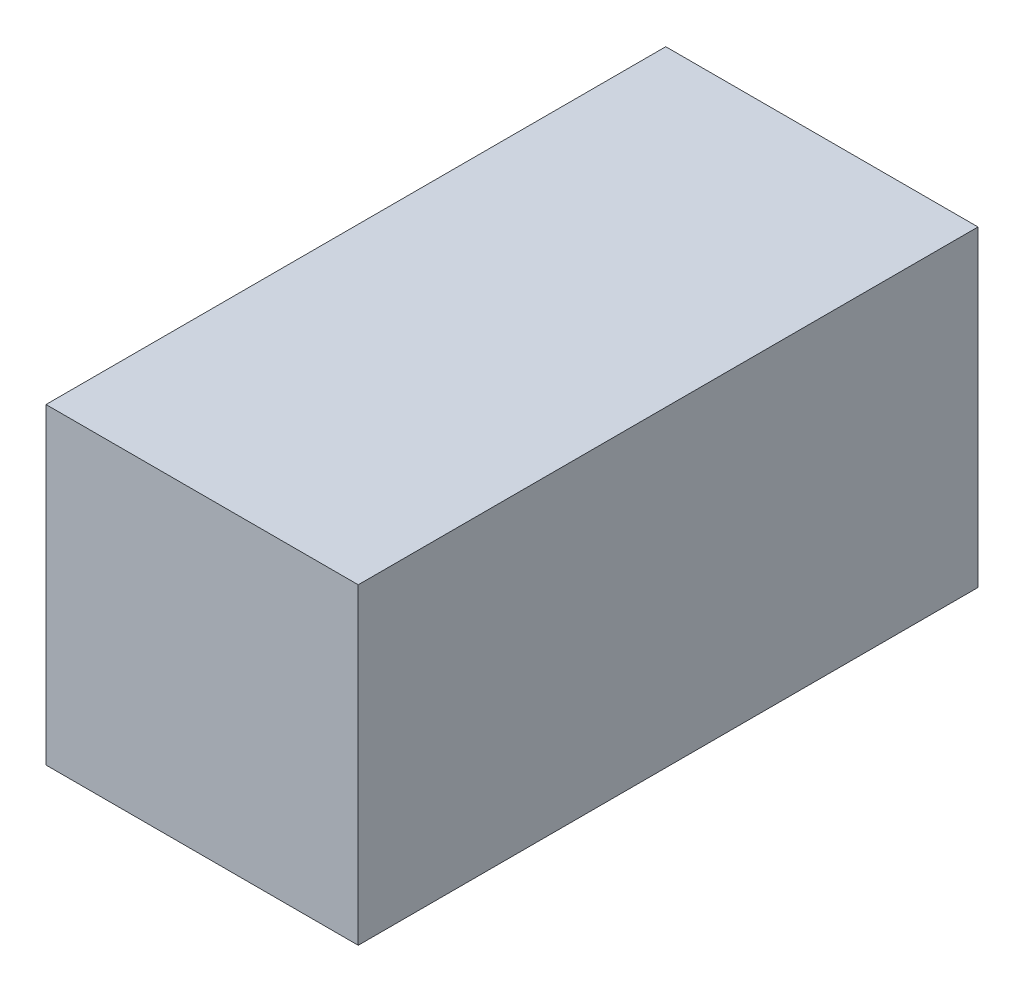
ISO-10303-21;
HEADER;
FILE_DESCRIPTION(('STEP AP214'),'2;1');
FILE_NAME('part.step','',(''),(''),'','','');
FILE_SCHEMA(('AUTOMOTIVE_DESIGN { 1 0 10303 214 1 1 1 1 }'));
ENDSEC;
DATA;
#1=APPLICATION_CONTEXT('core data for automotive mechanical design processes');
#2=APPLICATION_PROTOCOL_DEFINITION('international standard','automotive_design',2000,#1);
#3=PRODUCT_CONTEXT('',#1,'mechanical');
#4=PRODUCT('Part','Part','',(#3));
#5=PRODUCT_RELATED_PRODUCT_CATEGORY('part','',(#4));
#6=PRODUCT_DEFINITION_FORMATION('','',#4);
#7=PRODUCT_DEFINITION_CONTEXT('part definition',#1,'design');
#8=PRODUCT_DEFINITION('design','',#6,#7);
#9=PRODUCT_DEFINITION_SHAPE('','',#8);
#10=(LENGTH_UNIT() NAMED_UNIT(*) SI_UNIT(.MILLI.,.METRE.));
#11=(NAMED_UNIT(*) PLANE_ANGLE_UNIT() SI_UNIT($,.RADIAN.));
#12=(NAMED_UNIT(*) SI_UNIT($,.STERADIAN.) SOLID_ANGLE_UNIT());
#13=UNCERTAINTY_MEASURE_WITH_UNIT(LENGTH_MEASURE(1.E-05),#10,'distance_accuracy_value','');
#14=(GEOMETRIC_REPRESENTATION_CONTEXT(3) GLOBAL_UNCERTAINTY_ASSIGNED_CONTEXT((#13)) GLOBAL_UNIT_ASSIGNED_CONTEXT((#10,
#11,#12)) REPRESENTATION_CONTEXT('',''));
#15=CARTESIAN_POINT('',(0.,0.,0.));
#16=DIRECTION('',(0.,0.,1.));
#17=DIRECTION('',(1.,0.,0.));
#18=AXIS2_PLACEMENT_3D('',#15,#16,#17);
#19=CARTESIAN_POINT('',(1.4133390097555,-1.4133390097555,5.61081302997394));
#20=DIRECTION('',(-1.,0.,0.));
#21=DIRECTION('',(0.,0.,1.));
#22=AXIS2_PLACEMENT_3D('',#19,#20,#21);
#23=PLANE('',#22);
#24=DIRECTION('',(0.,0.,-1.));
#25=VECTOR('',#24,1.);
#26=CARTESIAN_POINT('',(1.4133390097555,1.4133390097555,5.61081302997394));
#27=LINE('',#26,#25);
#28=CARTESIAN_POINT('',(1.4133390097555,1.4133390097555,0.));
#29=VERTEX_POINT('',#28);
#30=CARTESIAN_POINT('',(1.4133390097555,1.4133390097555,5.61081302997394));
#31=VERTEX_POINT('',#30);
#32=EDGE_CURVE('E20',#29,#31,#27,.F.);
#33=ORIENTED_EDGE('',*,*,#32,.T.);
#34=DIRECTION('',(0.,1.,0.));
#35=VECTOR('',#34,1.);
#36=CARTESIAN_POINT('',(1.4133390097555,-1.4133390097555,5.61081302997394));
#37=LINE('',#36,#35);
#38=CARTESIAN_POINT('',(1.4133390097555,-1.4133390097555,5.61081302997394));
#39=VERTEX_POINT('',#38);
#40=EDGE_CURVE('E55',#39,#31,#37,.T.);
#41=ORIENTED_EDGE('',*,*,#40,.F.);
#42=DIRECTION('',(0.,0.,1.));
#43=VECTOR('',#42,1.);
#44=CARTESIAN_POINT('',(1.4133390097555,-1.4133390097555,5.61081302997394));
#45=LINE('',#44,#43);
#46=CARTESIAN_POINT('',(1.4133390097555,-1.4133390097555,0.));
#47=VERTEX_POINT('',#46);
#48=EDGE_CURVE('E74',#39,#47,#45,.F.);
#49=ORIENTED_EDGE('',*,*,#48,.T.);
#50=DIRECTION('',(0.,1.,0.));
#51=VECTOR('',#50,1.);
#52=CARTESIAN_POINT('',(1.4133390097555,-1.4133390097555,0.));
#53=LINE('',#52,#51);
#54=EDGE_CURVE('E66',#47,#29,#53,.T.);
#55=ORIENTED_EDGE('',*,*,#54,.T.);
#56=EDGE_LOOP('',(#33,#41,#49,#55));
#57=FACE_BOUND('',#56,.T.);
#58=ADVANCED_FACE('F17',(#57),#23,.F.);
#59=CARTESIAN_POINT('',(1.4133390097555,1.4133390097555,5.61081302997394));
#60=DIRECTION('',(0.,-1.,0.));
#61=DIRECTION('',(0.,0.,-1.));
#62=AXIS2_PLACEMENT_3D('',#59,#60,#61);
#63=PLANE('',#62);
#64=DIRECTION('',(0.,0.,-1.));
#65=VECTOR('',#64,1.);
#66=CARTESIAN_POINT('',(-1.4133390097555,1.4133390097555,5.61081302997394));
#67=LINE('',#66,#65);
#68=CARTESIAN_POINT('',(-1.4133390097555,1.4133390097555,0.));
#69=VERTEX_POINT('',#68);
#70=CARTESIAN_POINT('',(-1.4133390097555,1.4133390097555,5.61081302997394));
#71=VERTEX_POINT('',#70);
#72=EDGE_CURVE('E72',#69,#71,#67,.F.);
#73=ORIENTED_EDGE('',*,*,#72,.T.);
#74=DIRECTION('',(1.,0.,0.));
#75=VECTOR('',#74,1.);
#76=CARTESIAN_POINT('',(-1.4133390097555,1.4133390097555,5.61081302997394));
#77=LINE('',#76,#75);
#78=EDGE_CURVE('E62',#31,#71,#77,.F.);
#79=ORIENTED_EDGE('',*,*,#78,.F.);
#80=ORIENTED_EDGE('',*,*,#32,.F.);
#81=DIRECTION('',(1.,0.,0.));
#82=VECTOR('',#81,1.);
#83=CARTESIAN_POINT('',(-1.4133390097555,1.4133390097555,0.));
#84=LINE('',#83,#82);
#85=EDGE_CURVE('E80',#29,#69,#84,.F.);
#86=ORIENTED_EDGE('',*,*,#85,.T.);
#87=EDGE_LOOP('',(#73,#79,#80,#86));
#88=FACE_BOUND('',#87,.T.);
#89=ADVANCED_FACE('F71',(#88),#63,.F.);
#90=CARTESIAN_POINT('',(-1.4133390097555,-1.4133390097555,5.61081302997394));
#91=DIRECTION('',(0.,0.,1.));
#92=DIRECTION('',(1.,0.,0.));
#93=AXIS2_PLACEMENT_3D('',#90,#91,#92);
#94=PLANE('',#93);
#95=ORIENTED_EDGE('',*,*,#40,.T.);
#96=ORIENTED_EDGE('',*,*,#78,.T.);
#97=DIRECTION('',(0.,1.,0.));
#98=VECTOR('',#97,1.);
#99=CARTESIAN_POINT('',(-1.4133390097555,1.4133390097555,5.61081302997394));
#100=LINE('',#99,#98);
#101=CARTESIAN_POINT('',(-1.4133390097555,-1.4133390097555,5.61081302997394));
#102=VERTEX_POINT('',#101);
#103=EDGE_CURVE('E83',#71,#102,#100,.F.);
#104=ORIENTED_EDGE('',*,*,#103,.T.);
#105=DIRECTION('',(1.,0.,0.));
#106=VECTOR('',#105,1.);
#107=CARTESIAN_POINT('',(-1.4133390097555,-1.4133390097555,5.61081302997394));
#108=LINE('',#107,#106);
#109=EDGE_CURVE('E64',#102,#39,#108,.T.);
#110=ORIENTED_EDGE('',*,*,#109,.T.);
#111=EDGE_LOOP('',(#95,#96,#104,#110));
#112=FACE_BOUND('',#111,.T.);
#113=ADVANCED_FACE('F59',(#112),#94,.T.);
#114=CARTESIAN_POINT('',(-1.4133390097555,-1.4133390097555,5.61081302997394));
#115=DIRECTION('',(0.,1.,0.));
#116=DIRECTION('',(0.,0.,1.));
#117=AXIS2_PLACEMENT_3D('',#114,#115,#116);
#118=PLANE('',#117);
#119=ORIENTED_EDGE('',*,*,#48,.F.);
#120=ORIENTED_EDGE('',*,*,#109,.F.);
#121=DIRECTION('',(0.,0.,-1.));
#122=VECTOR('',#121,1.);
#123=CARTESIAN_POINT('',(-1.4133390097555,-1.4133390097555,5.61081302997394));
#124=LINE('',#123,#122);
#125=CARTESIAN_POINT('',(-1.4133390097555,-1.4133390097555,0.));
#126=VERTEX_POINT('',#125);
#127=EDGE_CURVE('E26',#102,#126,#124,.T.);
#128=ORIENTED_EDGE('',*,*,#127,.T.);
#129=DIRECTION('',(1.,0.,0.));
#130=VECTOR('',#129,1.);
#131=CARTESIAN_POINT('',(-1.4133390097555,-1.4133390097555,0.));
#132=LINE('',#131,#130);
#133=EDGE_CURVE('E34',#126,#47,#132,.T.);
#134=ORIENTED_EDGE('',*,*,#133,.T.);
#135=EDGE_LOOP('',(#119,#120,#128,#134));
#136=FACE_BOUND('',#135,.T.);
#137=ADVANCED_FACE('F88',(#136),#118,.F.);
#138=CARTESIAN_POINT('',(-1.4133390097555,-1.4133390097555,0.));
#139=DIRECTION('',(0.,0.,1.));
#140=DIRECTION('',(1.,0.,0.));
#141=AXIS2_PLACEMENT_3D('',#138,#139,#140);
#142=PLANE('',#141);
#143=ORIENTED_EDGE('',*,*,#85,.F.);
#144=ORIENTED_EDGE('',*,*,#54,.F.);
#145=ORIENTED_EDGE('',*,*,#133,.F.);
#146=DIRECTION('',(0.,1.,0.));
#147=VECTOR('',#146,1.);
#148=CARTESIAN_POINT('',(-1.4133390097555,1.4133390097555,0.));
#149=LINE('',#148,#147);
#150=EDGE_CURVE('E11',#126,#69,#149,.T.);
#151=ORIENTED_EDGE('',*,*,#150,.T.);
#152=EDGE_LOOP('',(#143,#144,#145,#151));
#153=FACE_BOUND('',#152,.T.);
#154=ADVANCED_FACE('F91',(#153),#142,.F.);
#155=CARTESIAN_POINT('',(-1.4133390097555,1.4133390097555,5.61081302997394));
#156=DIRECTION('',(1.,0.,0.));
#157=DIRECTION('',(0.,0.,-1.));
#158=AXIS2_PLACEMENT_3D('',#155,#156,#157);
#159=PLANE('',#158);
#160=ORIENTED_EDGE('',*,*,#127,.F.);
#161=ORIENTED_EDGE('',*,*,#103,.F.);
#162=ORIENTED_EDGE('',*,*,#72,.F.);
#163=ORIENTED_EDGE('',*,*,#150,.F.);
#164=EDGE_LOOP('',(#160,#161,#162,#163));
#165=FACE_BOUND('',#164,.T.);
#166=ADVANCED_FACE('F90',(#165),#159,.F.);
#167=CLOSED_SHELL('',(#58,#89,#113,#137,#154,#166));
#168=MANIFOLD_SOLID_BREP('B1',#167);
#169=ADVANCED_BREP_SHAPE_REPRESENTATION('',(#18,#168),#14);
#170=SHAPE_DEFINITION_REPRESENTATION(#9,#169);
ENDSEC;
END-ISO-10303-21;
